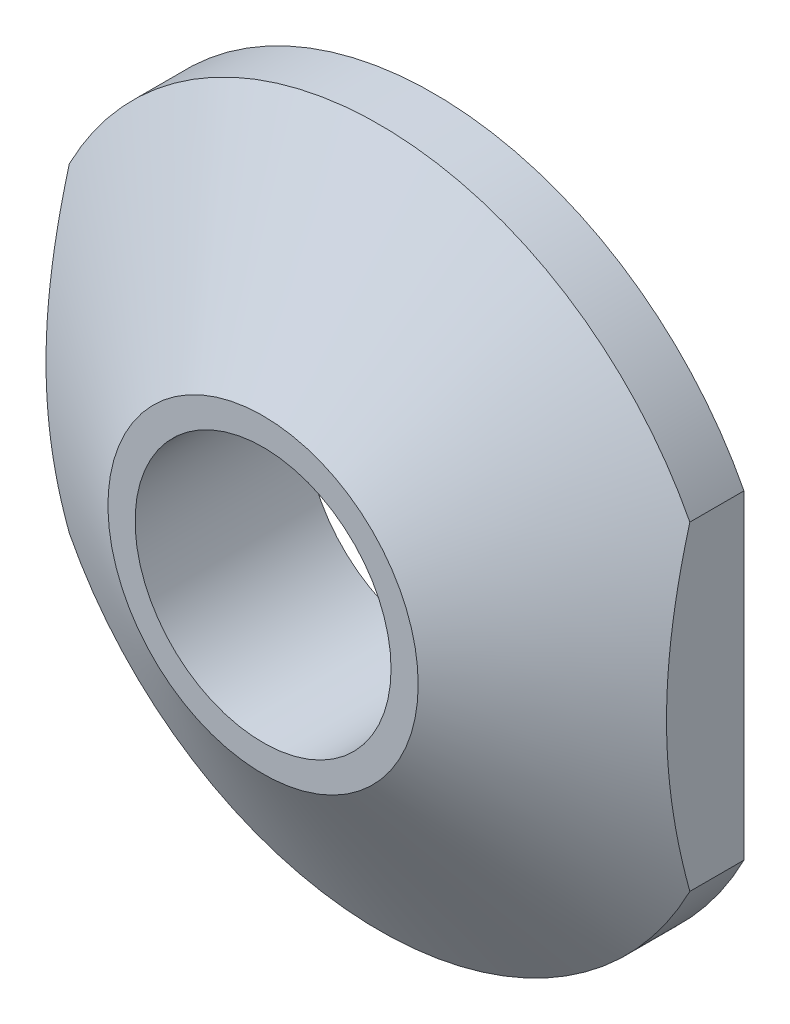
ISO-10303-21;
HEADER;
FILE_DESCRIPTION(('STEP AP214'),'2;1');
FILE_NAME('part.step','',(''),(''),'','','');
FILE_SCHEMA(('AUTOMOTIVE_DESIGN { 1 0 10303 214 1 1 1 1 }'));
ENDSEC;
DATA;
#1=APPLICATION_CONTEXT('core data for automotive mechanical design processes');
#2=APPLICATION_PROTOCOL_DEFINITION('international standard','automotive_design',2000,#1);
#3=PRODUCT_CONTEXT('',#1,'mechanical');
#4=PRODUCT('Part','Part','',(#3));
#5=PRODUCT_RELATED_PRODUCT_CATEGORY('part','',(#4));
#6=PRODUCT_DEFINITION_FORMATION('','',#4);
#7=PRODUCT_DEFINITION_CONTEXT('part definition',#1,'design');
#8=PRODUCT_DEFINITION('design','',#6,#7);
#9=PRODUCT_DEFINITION_SHAPE('','',#8);
#10=(LENGTH_UNIT() NAMED_UNIT(*) SI_UNIT(.MILLI.,.METRE.));
#11=(NAMED_UNIT(*) PLANE_ANGLE_UNIT() SI_UNIT($,.RADIAN.));
#12=(NAMED_UNIT(*) SI_UNIT($,.STERADIAN.) SOLID_ANGLE_UNIT());
#13=UNCERTAINTY_MEASURE_WITH_UNIT(LENGTH_MEASURE(1.E-05),#10,'distance_accuracy_value','');
#14=(GEOMETRIC_REPRESENTATION_CONTEXT(3) GLOBAL_UNCERTAINTY_ASSIGNED_CONTEXT((#13)) GLOBAL_UNIT_ASSIGNED_CONTEXT((#10,
#11,#12)) REPRESENTATION_CONTEXT('',''));
#15=CARTESIAN_POINT('',(0.,0.,0.));
#16=DIRECTION('',(0.,0.,1.));
#17=DIRECTION('',(1.,0.,0.));
#18=AXIS2_PLACEMENT_3D('',#15,#16,#17);
#19=CARTESIAN_POINT('',(4.5,0.,-2.2));
#20=DIRECTION('',(0.,0.,-1.));
#21=DIRECTION('',(-1.,0.,0.));
#22=AXIS2_PLACEMENT_3D('',#19,#20,#21);
#23=PLANE('',#22);
#24=CARTESIAN_POINT('',(0.,0.,-2.2));
#25=DIRECTION('',(0.,0.,1.));
#26=DIRECTION('',(1.,0.,0.));
#27=AXIS2_PLACEMENT_3D('',#24,#25,#26);
#28=CIRCLE('',#27,1.65);
#29=CARTESIAN_POINT('',(1.65,0.,-2.2));
#30=VERTEX_POINT('',#29);
#31=EDGE_CURVE('E106',#30,#30,#28,.T.);
#32=ORIENTED_EDGE('',*,*,#31,.T.);
#33=EDGE_LOOP('',(#32));
#34=FACE_BOUND('',#33,.T.);
#35=CARTESIAN_POINT('',(0.,0.,-2.2));
#36=DIRECTION('',(0.,0.,1.));
#37=DIRECTION('',(1.,0.,0.));
#38=AXIS2_PLACEMENT_3D('',#35,#36,#37);
#39=CIRCLE('',#38,4.5);
#40=CARTESIAN_POINT('',(-4.,-2.06155281280883,-2.2));
#41=VERTEX_POINT('',#40);
#42=CARTESIAN_POINT('',(4.,-2.06155281280883,-2.2));
#43=VERTEX_POINT('',#42);
#44=EDGE_CURVE('E97',#41,#43,#39,.T.);
#45=ORIENTED_EDGE('',*,*,#44,.F.);
#46=DIRECTION('',(0.,1.,0.));
#47=VECTOR('',#46,1.);
#48=CARTESIAN_POINT('',(-4.,3.45991887060746,-2.2));
#49=LINE('',#48,#47);
#50=CARTESIAN_POINT('',(-4.,2.06155281280883,-2.2));
#51=VERTEX_POINT('',#50);
#52=EDGE_CURVE('E84',#41,#51,#49,.T.);
#53=ORIENTED_EDGE('',*,*,#52,.T.);
#54=CARTESIAN_POINT('',(4.,2.06155281280883,-2.2));
#55=VERTEX_POINT('',#54);
#56=EDGE_CURVE('E103',#55,#51,#39,.T.);
#57=ORIENTED_EDGE('',*,*,#56,.F.);
#58=DIRECTION('',(0.,1.,0.));
#59=VECTOR('',#58,1.);
#60=CARTESIAN_POINT('',(4.,3.45991887060746,-2.2));
#61=LINE('',#60,#59);
#62=EDGE_CURVE('E100',#43,#55,#61,.T.);
#63=ORIENTED_EDGE('',*,*,#62,.F.);
#64=EDGE_LOOP('',(#45,#53,#57,#63));
#65=FACE_BOUND('',#64,.T.);
#66=ADVANCED_FACE('F40',(#34,#65),#23,.T.);
#67=CARTESIAN_POINT('',(0.,0.,0.));
#68=DIRECTION('',(0.,0.,1.));
#69=DIRECTION('',(1.,0.,0.));
#70=AXIS2_PLACEMENT_3D('',#67,#68,#69);
#71=CYLINDRICAL_SURFACE('',#70,4.5);
#72=CARTESIAN_POINT('',(0.,0.,-1.50215154756892));
#73=DIRECTION('',(0.,0.,1.));
#74=DIRECTION('',(1.,0.,0.));
#75=AXIS2_PLACEMENT_3D('',#72,#73,#74);
#76=CIRCLE('',#75,4.5);
#77=CARTESIAN_POINT('',(-4.,-2.06155281280883,-1.50215154756892));
#78=VERTEX_POINT('',#77);
#79=CARTESIAN_POINT('',(4.,-2.06155281280911,-1.50215154756874));
#80=VERTEX_POINT('',#79);
#81=EDGE_CURVE('E99',#78,#80,#76,.T.);
#82=ORIENTED_EDGE('',*,*,#81,.F.);
#83=DIRECTION('',(0.,0.,1.));
#84=VECTOR('',#83,1.);
#85=CARTESIAN_POINT('',(-4.,-2.06155281280883,0.));
#86=LINE('',#85,#84);
#87=EDGE_CURVE('E60',#78,#41,#86,.F.);
#88=ORIENTED_EDGE('',*,*,#87,.T.);
#89=ORIENTED_EDGE('',*,*,#44,.T.);
#90=DIRECTION('',(0.,0.,1.));
#91=VECTOR('',#90,1.);
#92=CARTESIAN_POINT('',(4.,-2.06155281280883,0.));
#93=LINE('',#92,#91);
#94=EDGE_CURVE('E149',#80,#43,#93,.F.);
#95=ORIENTED_EDGE('',*,*,#94,.F.);
#96=EDGE_LOOP('',(#82,#88,#89,#95));
#97=FACE_BOUND('',#96,.T.);
#98=ADVANCED_FACE('F95',(#97),#71,.T.);
#99=ORIENTED_EDGE('',*,*,#56,.T.);
#100=DIRECTION('',(0.,0.,1.));
#101=VECTOR('',#100,1.);
#102=CARTESIAN_POINT('',(-4.,2.06155281280883,0.));
#103=LINE('',#102,#101);
#104=CARTESIAN_POINT('',(-4.,2.06155281280883,-1.50215154756892));
#105=VERTEX_POINT('',#104);
#106=EDGE_CURVE('E87',#51,#105,#103,.T.);
#107=ORIENTED_EDGE('',*,*,#106,.T.);
#108=CARTESIAN_POINT('',(4.,2.06155281280883,-1.50215154756892));
#109=VERTEX_POINT('',#108);
#110=EDGE_CURVE('E104',#109,#105,#76,.T.);
#111=ORIENTED_EDGE('',*,*,#110,.F.);
#112=DIRECTION('',(0.,0.,1.));
#113=VECTOR('',#112,1.);
#114=CARTESIAN_POINT('',(4.,2.06155281280883,0.));
#115=LINE('',#114,#113);
#116=EDGE_CURVE('E67',#55,#109,#115,.T.);
#117=ORIENTED_EDGE('',*,*,#116,.F.);
#118=EDGE_LOOP('',(#99,#107,#111,#117));
#119=FACE_BOUND('',#118,.T.);
#120=ADVANCED_FACE('F125',(#119),#71,.T.);
#121=CARTESIAN_POINT('',(0.,0.,0.));
#122=DIRECTION('',(0.,0.,-1.));
#123=DIRECTION('',(-1.,0.,0.));
#124=AXIS2_PLACEMENT_3D('',#121,#122,#123);
#125=CONICAL_SURFACE('',#124,2.,1.02974425867665);
#126=CARTESIAN_POINT('',(0.,0.,0.));
#127=DIRECTION('',(0.,0.,1.));
#128=DIRECTION('',(1.,0.,0.));
#129=AXIS2_PLACEMENT_3D('',#126,#127,#128);
#130=CIRCLE('',#129,2.);
#131=CARTESIAN_POINT('',(2.,0.,0.));
#132=VERTEX_POINT('',#131);
#133=EDGE_CURVE('E148',#132,#132,#130,.T.);
#134=ORIENTED_EDGE('',*,*,#133,.F.);
#135=EDGE_LOOP('',(#134));
#136=FACE_BOUND('',#135,.T.);
#137=ORIENTED_EDGE('',*,*,#110,.T.);
#138=CARTESIAN_POINT('',(-4.,-7.16973076944879,-3.73137881628343));
#139=CARTESIAN_POINT('',(-4.,-6.98604958966537,-3.63501577865199));
#140=CARTESIAN_POINT('',(-4.,-6.80201823406373,-3.53931209845727));
#141=CARTESIAN_POINT('',(-4.,-6.43307159578137,-3.34958166391106));
#142=CARTESIAN_POINT('',(-4.,-6.24815623042299,-3.25555507046107));
#143=CARTESIAN_POINT('',(-4.,-5.87664585981444,-3.06923099580526));
#144=CARTESIAN_POINT('',(-4.,-5.69004724496063,-2.97694069413591));
#145=CARTESIAN_POINT('',(-4.,-5.31559705796956,-2.79494784205013));
#146=CARTESIAN_POINT('',(-4.,-5.12774552733297,-2.70524520644069));
#147=CARTESIAN_POINT('',(-4.,-4.74060060088183,-2.52447059233619));
#148=CARTESIAN_POINT('',(-4.,-4.54122476851816,-2.43357444754045));
#149=CARTESIAN_POINT('',(-4.,-4.14037656444175,-2.25645256709929));
#150=CARTESIAN_POINT('',(-4.,-3.93890400310997,-2.17022725831719));
#151=CARTESIAN_POINT('',(-4.,-3.53367965834559,-2.00402549407662));
#152=CARTESIAN_POINT('',(-4.,-3.32993111896641,-1.92404118878508));
#153=CARTESIAN_POINT('',(-4.,-2.91944779637651,-1.77220572289273));
#154=CARTESIAN_POINT('',(-4.,-2.7127137231789,-1.70035266331709));
#155=CARTESIAN_POINT('',(-4.,-2.29779835536364,-1.56806265202447));
#156=CARTESIAN_POINT('',(-4.,-2.0896510077527,-1.50752088804364));
#157=CARTESIAN_POINT('',(-4.,-1.66978727506995,-1.40022906140694));
#158=CARTESIAN_POINT('',(-4.,-1.45807126539972,-1.35347755755332));
#159=CARTESIAN_POINT('',(-4.,-1.03526140746423,-1.27801547201038));
#160=CARTESIAN_POINT('',(-4.,-0.824224994474798,-1.24899521196736));
#161=CARTESIAN_POINT('',(-4.,-0.506381274660971,-1.22008167536194));
#162=CARTESIAN_POINT('',(-4.,-0.400210117677285,-1.21287998064459));
#163=CARTESIAN_POINT('',(-4.,-0.187649696418142,-1.2035228302785));
#164=CARTESIAN_POINT('',(-4.,-0.0812604549563238,-1.20136687131744));
#165=CARTESIAN_POINT('',(-4.,0.140198220592843,-1.20220324007196));
#166=CARTESIAN_POINT('',(-4.,0.255266286163674,-1.20563082862973));
#167=CARTESIAN_POINT('',(-4.,0.48506784827352,-1.21835079691277));
#168=CARTESIAN_POINT('',(-4.,0.599801336479385,-1.22764332148065));
#169=CARTESIAN_POINT('',(-4.,0.943147051185223,-1.26392417072136));
#170=CARTESIAN_POINT('',(-4.,1.17091558552994,-1.29931585592432));
#171=CARTESIAN_POINT('',(-4.,1.51235213723323,-1.36692770057297));
#172=CARTESIAN_POINT('',(-4.,1.62747825748268,-1.39227268722355));
#173=CARTESIAN_POINT('',(-4.,1.85670741486824,-1.44727319220233));
#174=CARTESIAN_POINT('',(-4.,1.97081043510561,-1.47692878159087));
#175=CARTESIAN_POINT('',(-4.,2.19796916116621,-1.5400017887873));
#176=CARTESIAN_POINT('',(-4.,2.31102480613437,-1.57341942371395));
#177=CARTESIAN_POINT('',(-4.,2.53611089378304,-1.6435050961705));
#178=CARTESIAN_POINT('',(-4.,2.64814140265688,-1.6801729221773));
#179=CARTESIAN_POINT('',(-4.,3.00188366626907,-1.80086549809847));
#180=CARTESIAN_POINT('',(-4.,3.24183194072724,-1.89006495595127));
#181=CARTESIAN_POINT('',(-4.,3.7180389802369,-2.0778765506045));
#182=CARTESIAN_POINT('',(-4.,3.95429649284891,-2.17649180519316));
#183=CARTESIAN_POINT('',(-4.,4.42409272142871,-2.38065167883809));
#184=CARTESIAN_POINT('',(-4.,4.65762813373683,-2.48620385702286));
#185=CARTESIAN_POINT('',(-4.,5.1223165251575,-2.70232489814056));
#186=CARTESIAN_POINT('',(-4.,5.35346979453275,-2.81289314078337));
#187=CARTESIAN_POINT('',(-4.,5.81488336456121,-3.0382759359685));
#188=CARTESIAN_POINT('',(-4.,6.04513593798152,-3.15310625415701));
#189=CARTESIAN_POINT('',(-4.,6.50416695927935,-3.38568266076254));
#190=CARTESIAN_POINT('',(-4.,6.73294536989808,-3.5034288225147));
#191=CARTESIAN_POINT('',(-4.,7.18917473887442,-3.74111359529021));
#192=CARTESIAN_POINT('',(-4.,7.41662644378259,-3.86105077595371));
#193=CARTESIAN_POINT('',(-4.,7.87057453106844,-4.10272100316264));
#194=CARTESIAN_POINT('',(-4.,8.0970709061198,-4.22445406344839));
#195=CARTESIAN_POINT('',(-4.,8.71449084408437,-4.55882075891464));
#196=CARTESIAN_POINT('',(-4.,9.10463954485406,-4.77288449182076));
#197=CARTESIAN_POINT('',(-4.,9.88332866131209,-5.20406944372792));
#198=CARTESIAN_POINT('',(-4.,10.2718687815613,-5.42119119472074));
#199=CARTESIAN_POINT('',(-4.,11.0445955893027,-5.85589060570961));
#200=CARTESIAN_POINT('',(-4.,11.4287922010362,-6.07345064556487));
#201=CARTESIAN_POINT('',(-4.,12.1961593451792,-6.51019366770621));
#202=CARTESIAN_POINT('',(-4.,12.5793300696036,-6.72937631244802));
#203=CARTESIAN_POINT('',(-4.,12.9621638386806,-6.94914056573623));
#204=B_SPLINE_CURVE_WITH_KNOTS('',3,(#138,#139,#140,#141,#142,#143,#144,#145,#146,#147,#148,
#149,#150,#151,#152,#153,#154,#155,#156,#157,#158,#159,#160,#161,#162,#163,#164,#165,#166,#167,
#168,#169,#170,#171,#172,#173,#174,#175,#176,#177,#178,#179,#180,#181,#182,#183,#184,#185,#186,
#187,#188,#189,#190,#191,#192,#193,#194,#195,#196,#197,#198,#199,#200,#201,#202,#203),
.UNSPECIFIED.,.F.,.F.,(4,2,2,2,2,2,2,2,2,2,2,2,2,2,2,2,2,2,2,2,2,2,2,2,2,2,2,2,2,2,2,2,4),(0.,
0.622275530215867,1.24461044451532,1.86911722455093,2.49360342060488,3.15091245790793,
3.80828146507443,4.46480984988511,5.12118459094901,5.77113766857223,6.42102279656648,
7.05920644668837,7.37834847227421,7.69745866207355,8.04265494952985,8.387859762414,
9.07823636100441,9.43182892360691,9.78542731584846,10.1390461257705,10.4926419389823,
11.260296829746,12.0282067962015,12.7969678882902,13.5656341725952,14.3375014475152,
15.1093881550948,15.8807877881714,16.652193326311,17.9872199659376,19.3224817963601,
20.6470353718203,21.9713207428964),.UNSPECIFIED.);
#205=EDGE_CURVE('E11',#105,#78,#204,.F.);
#206=ORIENTED_EDGE('',*,*,#205,.T.);
#207=ORIENTED_EDGE('',*,*,#81,.T.);
#208=CARTESIAN_POINT('',(4.,-7.16973076944879,-3.73137881628343));
#209=CARTESIAN_POINT('',(4.,-6.98604958966537,-3.63501577865199));
#210=CARTESIAN_POINT('',(4.,-6.80201823406373,-3.53931209845727));
#211=CARTESIAN_POINT('',(4.,-6.43307159578137,-3.34958166391106));
#212=CARTESIAN_POINT('',(4.,-6.24815623042299,-3.25555507046107));
#213=CARTESIAN_POINT('',(4.,-5.87664585981444,-3.06923099580526));
#214=CARTESIAN_POINT('',(4.,-5.69004724496063,-2.97694069413591));
#215=CARTESIAN_POINT('',(4.,-5.31559705796956,-2.79494784205013));
#216=CARTESIAN_POINT('',(4.,-5.12774552733297,-2.70524520644069));
#217=CARTESIAN_POINT('',(4.,-4.74060060088183,-2.52447059233619));
#218=CARTESIAN_POINT('',(4.,-4.54122476851816,-2.43357444754045));
#219=CARTESIAN_POINT('',(4.,-4.14037656444175,-2.25645256709929));
#220=CARTESIAN_POINT('',(4.,-3.93890400310997,-2.17022725831719));
#221=CARTESIAN_POINT('',(4.,-3.53367965834559,-2.00402549407662));
#222=CARTESIAN_POINT('',(4.,-3.32993111896641,-1.92404118878508));
#223=CARTESIAN_POINT('',(4.,-2.91944779637651,-1.77220572289273));
#224=CARTESIAN_POINT('',(4.,-2.7127137231789,-1.70035266331709));
#225=CARTESIAN_POINT('',(4.,-2.29779835536364,-1.56806265202447));
#226=CARTESIAN_POINT('',(4.,-2.0896510077527,-1.50752088804364));
#227=CARTESIAN_POINT('',(4.,-1.66978727506995,-1.40022906140694));
#228=CARTESIAN_POINT('',(4.,-1.45807126539972,-1.35347755755332));
#229=CARTESIAN_POINT('',(4.,-1.03526140746423,-1.27801547201038));
#230=CARTESIAN_POINT('',(4.,-0.824224994474798,-1.24899521196736));
#231=CARTESIAN_POINT('',(4.,-0.506381274660971,-1.22008167536194));
#232=CARTESIAN_POINT('',(4.,-0.400210117677285,-1.21287998064459));
#233=CARTESIAN_POINT('',(4.,-0.187649696418142,-1.2035228302785));
#234=CARTESIAN_POINT('',(4.,-0.0812604549563238,-1.20136687131744));
#235=CARTESIAN_POINT('',(4.,0.140198220592843,-1.20220324007196));
#236=CARTESIAN_POINT('',(4.,0.255266286163674,-1.20563082862973));
#237=CARTESIAN_POINT('',(4.,0.48506784827352,-1.21835079691277));
#238=CARTESIAN_POINT('',(4.,0.599801336479385,-1.22764332148065));
#239=CARTESIAN_POINT('',(4.,0.943147051185223,-1.26392417072136));
#240=CARTESIAN_POINT('',(4.,1.17091558552994,-1.29931585592432));
#241=CARTESIAN_POINT('',(4.,1.51235213723323,-1.36692770057297));
#242=CARTESIAN_POINT('',(4.,1.62747825748268,-1.39227268722355));
#243=CARTESIAN_POINT('',(4.,1.85670741486824,-1.44727319220233));
#244=CARTESIAN_POINT('',(4.,1.97081043510561,-1.47692878159087));
#245=CARTESIAN_POINT('',(4.,2.19796916116621,-1.5400017887873));
#246=CARTESIAN_POINT('',(4.,2.31102480613437,-1.57341942371395));
#247=CARTESIAN_POINT('',(4.,2.53611089378304,-1.6435050961705));
#248=CARTESIAN_POINT('',(4.,2.64814140265688,-1.6801729221773));
#249=CARTESIAN_POINT('',(4.,3.00188366626907,-1.80086549809847));
#250=CARTESIAN_POINT('',(4.,3.24183194072724,-1.89006495595127));
#251=CARTESIAN_POINT('',(4.,3.7180389802369,-2.0778765506045));
#252=CARTESIAN_POINT('',(4.,3.95429649284891,-2.17649180519316));
#253=CARTESIAN_POINT('',(4.,4.42409272142871,-2.38065167883809));
#254=CARTESIAN_POINT('',(4.,4.65762813373683,-2.48620385702286));
#255=CARTESIAN_POINT('',(4.,5.1223165251575,-2.70232489814056));
#256=CARTESIAN_POINT('',(4.,5.35346979453275,-2.81289314078337));
#257=CARTESIAN_POINT('',(4.,5.81488336456121,-3.0382759359685));
#258=CARTESIAN_POINT('',(4.,6.04513593798152,-3.15310625415701));
#259=CARTESIAN_POINT('',(4.,6.50416695927935,-3.38568266076254));
#260=CARTESIAN_POINT('',(4.,6.73294536989808,-3.5034288225147));
#261=CARTESIAN_POINT('',(4.,7.18917473887442,-3.74111359529021));
#262=CARTESIAN_POINT('',(4.,7.41662644378259,-3.86105077595371));
#263=CARTESIAN_POINT('',(4.,7.87057453106844,-4.10272100316264));
#264=CARTESIAN_POINT('',(4.,8.0970709061198,-4.22445406344839));
#265=CARTESIAN_POINT('',(4.,8.71449084408437,-4.55882075891464));
#266=CARTESIAN_POINT('',(4.,9.10463954485406,-4.77288449182076));
#267=CARTESIAN_POINT('',(4.,9.88332866131209,-5.20406944372792));
#268=CARTESIAN_POINT('',(4.,10.2718687815613,-5.42119119472074));
#269=CARTESIAN_POINT('',(4.,11.0445955893027,-5.85589060570961));
#270=CARTESIAN_POINT('',(4.,11.4287922010362,-6.07345064556487));
#271=CARTESIAN_POINT('',(4.,12.1961593451792,-6.51019366770621));
#272=CARTESIAN_POINT('',(4.,12.5793300696036,-6.72937631244802));
#273=CARTESIAN_POINT('',(4.,12.9621638386806,-6.94914056573623));
#274=B_SPLINE_CURVE_WITH_KNOTS('',3,(#208,#209,#210,#211,#212,#213,#214,#215,#216,#217,#218,
#219,#220,#221,#222,#223,#224,#225,#226,#227,#228,#229,#230,#231,#232,#233,#234,#235,#236,#237,
#238,#239,#240,#241,#242,#243,#244,#245,#246,#247,#248,#249,#250,#251,#252,#253,#254,#255,#256,
#257,#258,#259,#260,#261,#262,#263,#264,#265,#266,#267,#268,#269,#270,#271,#272,#273),
.UNSPECIFIED.,.F.,.F.,(4,2,2,2,2,2,2,2,2,2,2,2,2,2,2,2,2,2,2,2,2,2,2,2,2,2,2,2,2,2,2,2,4),(0.,
0.622275530215867,1.24461044451532,1.86911722455093,2.49360342060488,3.15091245790793,
3.80828146507443,4.46480984988511,5.12118459094901,5.77113766857223,6.42102279656648,
7.05920644668837,7.37834847227421,7.69745866207355,8.04265494952985,8.387859762414,
9.07823636100441,9.43182892360691,9.78542731584846,10.1390461257705,10.4926419389823,
11.260296829746,12.0282067962015,12.7969678882902,13.5656341725952,14.3375014475152,
15.1093881550948,15.8807877881714,16.652193326311,17.9872199659376,19.3224817963601,
20.6470353718203,21.9713207428964),.UNSPECIFIED.);
#275=EDGE_CURVE('E53',#109,#80,#274,.F.);
#276=ORIENTED_EDGE('',*,*,#275,.F.);
#277=EDGE_LOOP('',(#137,#206,#207,#276));
#278=FACE_BOUND('',#277,.T.);
#279=ADVANCED_FACE('F121',(#136,#278),#125,.T.);
#280=CARTESIAN_POINT('',(2.,0.,0.));
#281=DIRECTION('',(0.,0.,1.));
#282=DIRECTION('',(1.,0.,0.));
#283=AXIS2_PLACEMENT_3D('',#280,#281,#282);
#284=PLANE('',#283);
#285=ORIENTED_EDGE('',*,*,#133,.T.);
#286=EDGE_LOOP('',(#285));
#287=FACE_BOUND('',#286,.T.);
#288=CARTESIAN_POINT('',(0.,0.,0.));
#289=DIRECTION('',(0.,0.,1.));
#290=DIRECTION('',(1.,0.,0.));
#291=AXIS2_PLACEMENT_3D('',#288,#289,#290);
#292=CIRCLE('',#291,1.65);
#293=CARTESIAN_POINT('',(1.65,0.,0.));
#294=VERTEX_POINT('',#293);
#295=EDGE_CURVE('E113',#294,#294,#292,.T.);
#296=ORIENTED_EDGE('',*,*,#295,.F.);
#297=EDGE_LOOP('',(#296));
#298=FACE_BOUND('',#297,.T.);
#299=ADVANCED_FACE('F42',(#287,#298),#284,.T.);
#300=CARTESIAN_POINT('',(0.,0.,0.));
#301=DIRECTION('',(0.,0.,1.));
#302=DIRECTION('',(1.,0.,0.));
#303=AXIS2_PLACEMENT_3D('',#300,#301,#302);
#304=CYLINDRICAL_SURFACE('',#303,1.65);
#305=ORIENTED_EDGE('',*,*,#295,.T.);
#306=EDGE_LOOP('',(#305));
#307=FACE_BOUND('',#306,.T.);
#308=ORIENTED_EDGE('',*,*,#31,.F.);
#309=EDGE_LOOP('',(#308));
#310=FACE_BOUND('',#309,.T.);
#311=ADVANCED_FACE('F132',(#307,#310),#304,.F.);
#312=CARTESIAN_POINT('',(4.,3.45991887060746,0.));
#313=DIRECTION('',(-1.,0.,0.));
#314=DIRECTION('',(0.,0.,1.));
#315=AXIS2_PLACEMENT_3D('',#312,#313,#314);
#316=PLANE('',#315);
#317=ORIENTED_EDGE('',*,*,#94,.T.);
#318=ORIENTED_EDGE('',*,*,#62,.T.);
#319=ORIENTED_EDGE('',*,*,#116,.T.);
#320=ORIENTED_EDGE('',*,*,#275,.T.);
#321=EDGE_LOOP('',(#317,#318,#319,#320));
#322=FACE_BOUND('',#321,.T.);
#323=ADVANCED_FACE('F119',(#322),#316,.F.);
#324=CARTESIAN_POINT('',(-4.,3.45991887060746,0.));
#325=DIRECTION('',(-1.,0.,0.));
#326=DIRECTION('',(0.,0.,1.));
#327=AXIS2_PLACEMENT_3D('',#324,#325,#326);
#328=PLANE('',#327);
#329=ORIENTED_EDGE('',*,*,#205,.F.);
#330=ORIENTED_EDGE('',*,*,#106,.F.);
#331=ORIENTED_EDGE('',*,*,#52,.F.);
#332=ORIENTED_EDGE('',*,*,#87,.F.);
#333=EDGE_LOOP('',(#329,#330,#331,#332));
#334=FACE_BOUND('',#333,.T.);
#335=ADVANCED_FACE('F85',(#334),#328,.T.);
#336=CLOSED_SHELL('',(#66,#98,#120,#279,#299,#311,#323,#335));
#337=MANIFOLD_SOLID_BREP('B2',#336);
#338=ADVANCED_BREP_SHAPE_REPRESENTATION('',(#18,#337),#14);
#339=SHAPE_DEFINITION_REPRESENTATION(#9,#338);
ENDSEC;
END-ISO-10303-21;
